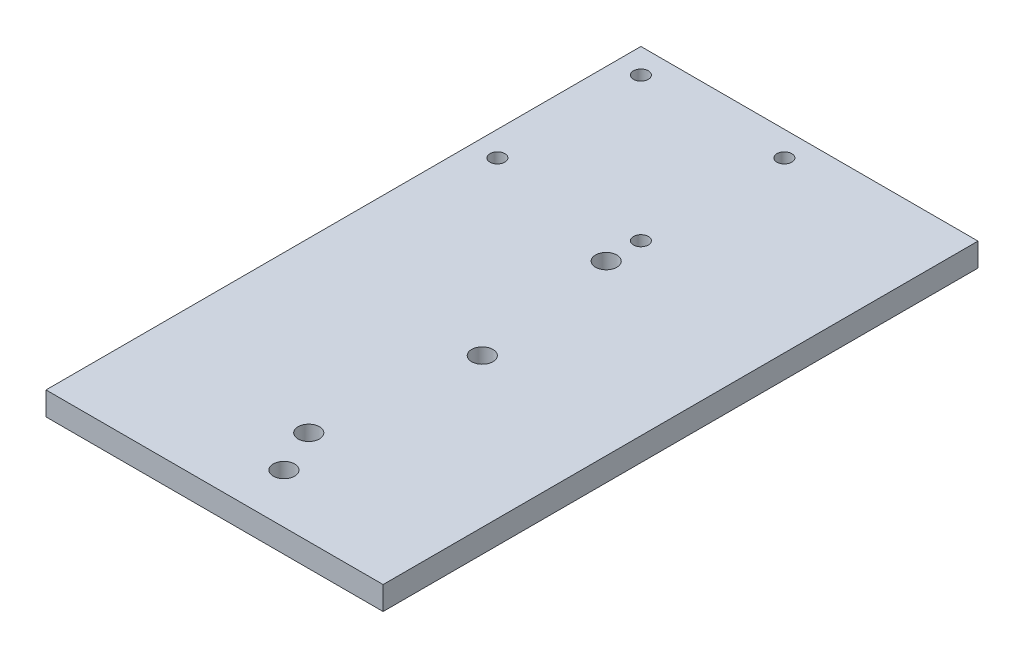
ISO-10303-21;
HEADER;
FILE_DESCRIPTION(('STEP AP214'),'2;1');
FILE_NAME('part.step','',(''),(''),'','','');
FILE_SCHEMA(('AUTOMOTIVE_DESIGN { 1 0 10303 214 1 1 1 1 }'));
ENDSEC;
DATA;
#1=APPLICATION_CONTEXT('core data for automotive mechanical design processes');
#2=APPLICATION_PROTOCOL_DEFINITION('international standard','automotive_design',2000,#1);
#3=PRODUCT_CONTEXT('',#1,'mechanical');
#4=PRODUCT('Part','Part','',(#3));
#5=PRODUCT_RELATED_PRODUCT_CATEGORY('part','',(#4));
#6=PRODUCT_DEFINITION_FORMATION('','',#4);
#7=PRODUCT_DEFINITION_CONTEXT('part definition',#1,'design');
#8=PRODUCT_DEFINITION('design','',#6,#7);
#9=PRODUCT_DEFINITION_SHAPE('','',#8);
#10=(LENGTH_UNIT() NAMED_UNIT(*) SI_UNIT(.MILLI.,.METRE.));
#11=(NAMED_UNIT(*) PLANE_ANGLE_UNIT() SI_UNIT($,.RADIAN.));
#12=(NAMED_UNIT(*) SI_UNIT($,.STERADIAN.) SOLID_ANGLE_UNIT());
#13=UNCERTAINTY_MEASURE_WITH_UNIT(LENGTH_MEASURE(1.E-05),#10,'distance_accuracy_value','');
#14=(GEOMETRIC_REPRESENTATION_CONTEXT(3) GLOBAL_UNCERTAINTY_ASSIGNED_CONTEXT((#13)) GLOBAL_UNIT_ASSIGNED_CONTEXT((#10,
#11,#12)) REPRESENTATION_CONTEXT('',''));
#15=CARTESIAN_POINT('',(0.,0.,0.));
#16=DIRECTION('',(0.,0.,1.));
#17=DIRECTION('',(1.,0.,0.));
#18=AXIS2_PLACEMENT_3D('',#15,#16,#17);
#19=CARTESIAN_POINT('',(0.,5.9944,0.));
#20=DIRECTION('',(0.,0.,-1.));
#21=DIRECTION('',(-1.,0.,0.));
#22=AXIS2_PLACEMENT_3D('',#19,#20,#21);
#23=PLANE('',#22);
#24=DIRECTION('',(1.,0.,0.));
#25=VECTOR('',#24,1.);
#26=CARTESIAN_POINT('',(0.,5.9944,0.));
#27=LINE('',#26,#25);
#28=CARTESIAN_POINT('',(2.54000000000002,5.9944,0.));
#29=VERTEX_POINT('',#28);
#30=CARTESIAN_POINT('',(88.9,5.9944,0.));
#31=VERTEX_POINT('',#30);
#32=EDGE_CURVE('E79',#29,#31,#27,.T.);
#33=ORIENTED_EDGE('',*,*,#32,.F.);
#34=DIRECTION('',(0.,1.,0.));
#35=VECTOR('',#34,1.);
#36=CARTESIAN_POINT('',(2.54000000000002,0.,0.));
#37=LINE('',#36,#35);
#38=CARTESIAN_POINT('',(2.54000000000002,0.,0.));
#39=VERTEX_POINT('',#38);
#40=EDGE_CURVE('E145',#39,#29,#37,.T.);
#41=ORIENTED_EDGE('',*,*,#40,.F.);
#42=DIRECTION('',(1.,0.,0.));
#43=VECTOR('',#42,1.);
#44=CARTESIAN_POINT('',(0.,0.,0.));
#45=LINE('',#44,#43);
#46=CARTESIAN_POINT('',(88.9,0.,0.));
#47=VERTEX_POINT('',#46);
#48=EDGE_CURVE('E87',#39,#47,#45,.T.);
#49=ORIENTED_EDGE('',*,*,#48,.T.);
#50=DIRECTION('',(0.,-1.,0.));
#51=VECTOR('',#50,1.);
#52=CARTESIAN_POINT('',(88.9,5.9944,0.));
#53=LINE('',#52,#51);
#54=EDGE_CURVE('E11',#31,#47,#53,.T.);
#55=ORIENTED_EDGE('',*,*,#54,.F.);
#56=EDGE_LOOP('',(#33,#41,#49,#55));
#57=FACE_BOUND('',#56,.T.);
#58=ADVANCED_FACE('F37',(#57),#23,.F.);
#59=CARTESIAN_POINT('',(88.9,5.9944,0.));
#60=DIRECTION('',(-1.,0.,0.));
#61=DIRECTION('',(0.,0.,1.));
#62=AXIS2_PLACEMENT_3D('',#59,#60,#61);
#63=PLANE('',#62);
#64=DIRECTION('',(0.,0.,-1.));
#65=VECTOR('',#64,1.);
#66=CARTESIAN_POINT('',(88.9,0.,0.));
#67=LINE('',#66,#65);
#68=CARTESIAN_POINT('',(88.9,0.,-152.4));
#69=VERTEX_POINT('',#68);
#70=EDGE_CURVE('E77',#47,#69,#67,.T.);
#71=ORIENTED_EDGE('',*,*,#70,.T.);
#72=DIRECTION('',(0.,-1.,0.));
#73=VECTOR('',#72,1.);
#74=CARTESIAN_POINT('',(88.9,5.9944,-152.4));
#75=LINE('',#74,#73);
#76=CARTESIAN_POINT('',(88.9,5.9944,-152.4));
#77=VERTEX_POINT('',#76);
#78=EDGE_CURVE('E44',#77,#69,#75,.T.);
#79=ORIENTED_EDGE('',*,*,#78,.F.);
#80=DIRECTION('',(0.,0.,-1.));
#81=VECTOR('',#80,1.);
#82=CARTESIAN_POINT('',(88.9,5.9944,0.));
#83=LINE('',#82,#81);
#84=EDGE_CURVE('E93',#31,#77,#83,.T.);
#85=ORIENTED_EDGE('',*,*,#84,.F.);
#86=ORIENTED_EDGE('',*,*,#54,.T.);
#87=EDGE_LOOP('',(#71,#79,#85,#86));
#88=FACE_BOUND('',#87,.T.);
#89=ADVANCED_FACE('F85',(#88),#63,.F.);
#90=CARTESIAN_POINT('',(0.,5.9944,-152.4));
#91=DIRECTION('',(0.,0.,-1.));
#92=DIRECTION('',(-1.,0.,0.));
#93=AXIS2_PLACEMENT_3D('',#90,#91,#92);
#94=PLANE('',#93);
#95=DIRECTION('',(0.,1.,0.));
#96=VECTOR('',#95,1.);
#97=CARTESIAN_POINT('',(2.54,0.,-152.4));
#98=LINE('',#97,#96);
#99=CARTESIAN_POINT('',(2.54000000000001,0.,-152.4));
#100=VERTEX_POINT('',#99);
#101=CARTESIAN_POINT('',(2.54,5.9944,-152.4));
#102=VERTEX_POINT('',#101);
#103=EDGE_CURVE('E51',#100,#102,#98,.T.);
#104=ORIENTED_EDGE('',*,*,#103,.T.);
#105=DIRECTION('',(1.,0.,0.));
#106=VECTOR('',#105,1.);
#107=CARTESIAN_POINT('',(0.,5.9944,-152.4));
#108=LINE('',#107,#106);
#109=EDGE_CURVE('E59',#102,#77,#108,.T.);
#110=ORIENTED_EDGE('',*,*,#109,.T.);
#111=ORIENTED_EDGE('',*,*,#78,.T.);
#112=DIRECTION('',(1.,0.,0.));
#113=VECTOR('',#112,1.);
#114=CARTESIAN_POINT('',(0.,0.,-152.4));
#115=LINE('',#114,#113);
#116=EDGE_CURVE('E73',#100,#69,#115,.T.);
#117=ORIENTED_EDGE('',*,*,#116,.F.);
#118=EDGE_LOOP('',(#104,#110,#111,#117));
#119=FACE_BOUND('',#118,.T.);
#120=ADVANCED_FACE('F82',(#119),#94,.T.);
#121=CARTESIAN_POINT('',(0.,5.9944,0.));
#122=DIRECTION('',(0.,1.,0.));
#123=DIRECTION('',(0.,0.,1.));
#124=AXIS2_PLACEMENT_3D('',#121,#122,#123);
#125=PLANE('',#124);
#126=DIRECTION('',(0.,0.,-1.));
#127=VECTOR('',#126,1.);
#128=CARTESIAN_POINT('',(2.54000000000002,5.9944,0.));
#129=LINE('',#128,#127);
#130=EDGE_CURVE('E139',#29,#102,#129,.T.);
#131=ORIENTED_EDGE('',*,*,#130,.F.);
#132=ORIENTED_EDGE('',*,*,#32,.T.);
#133=ORIENTED_EDGE('',*,*,#84,.T.);
#134=ORIENTED_EDGE('',*,*,#109,.F.);
#135=EDGE_LOOP('',(#131,#132,#133,#134));
#136=FACE_BOUND('',#135,.T.);
#137=CARTESIAN_POINT('',(45.6438,5.9944,-146.05));
#138=DIRECTION('',(0.,1.,0.));
#139=DIRECTION('',(0.,0.,1.));
#140=AXIS2_PLACEMENT_3D('',#137,#138,#139);
#141=CIRCLE('',#140,1.905);
#142=CARTESIAN_POINT('',(45.6438,5.9944,-144.145));
#143=VERTEX_POINT('',#142);
#144=EDGE_CURVE('E117',#143,#143,#141,.T.);
#145=ORIENTED_EDGE('',*,*,#144,.F.);
#146=EDGE_LOOP('',(#145));
#147=FACE_BOUND('',#146,.T.);
#148=CARTESIAN_POINT('',(8.89,5.9944,-146.05));
#149=DIRECTION('',(0.,1.,0.));
#150=DIRECTION('',(0.,0.,1.));
#151=AXIS2_PLACEMENT_3D('',#148,#149,#150);
#152=CIRCLE('',#151,1.90499999999999);
#153=CARTESIAN_POINT('',(8.89,5.9944,-144.145));
#154=VERTEX_POINT('',#153);
#155=EDGE_CURVE('E122',#154,#154,#152,.T.);
#156=ORIENTED_EDGE('',*,*,#155,.F.);
#157=EDGE_LOOP('',(#156));
#158=FACE_BOUND('',#157,.T.);
#159=CARTESIAN_POINT('',(8.89,5.9944,-109.2962));
#160=DIRECTION('',(0.,1.,0.));
#161=DIRECTION('',(0.,0.,1.));
#162=AXIS2_PLACEMENT_3D('',#159,#160,#161);
#163=CIRCLE('',#162,1.90500000000001);
#164=CARTESIAN_POINT('',(8.89,5.9944,-107.3912));
#165=VERTEX_POINT('',#164);
#166=EDGE_CURVE('E125',#165,#165,#163,.T.);
#167=ORIENTED_EDGE('',*,*,#166,.F.);
#168=EDGE_LOOP('',(#167));
#169=FACE_BOUND('',#168,.T.);
#170=CARTESIAN_POINT('',(45.6438,5.9944,-109.2962));
#171=DIRECTION('',(0.,1.,0.));
#172=DIRECTION('',(0.,0.,1.));
#173=AXIS2_PLACEMENT_3D('',#170,#171,#172);
#174=CIRCLE('',#173,1.905);
#175=CARTESIAN_POINT('',(45.6438,5.9944,-107.3912));
#176=VERTEX_POINT('',#175);
#177=EDGE_CURVE('E128',#176,#176,#174,.T.);
#178=ORIENTED_EDGE('',*,*,#177,.F.);
#179=EDGE_LOOP('',(#178));
#180=FACE_BOUND('',#179,.T.);
#181=CARTESIAN_POINT('',(50.8,5.9944,-63.5));
#182=DIRECTION('',(0.,1.,0.));
#183=DIRECTION('',(0.,0.,1.));
#184=AXIS2_PLACEMENT_3D('',#181,#182,#183);
#185=CIRCLE('',#184,2.7305);
#186=CARTESIAN_POINT('',(50.8,5.9944,-60.7695));
#187=VERTEX_POINT('',#186);
#188=EDGE_CURVE('E100',#187,#187,#185,.T.);
#189=ORIENTED_EDGE('',*,*,#188,.F.);
#190=EDGE_LOOP('',(#189));
#191=FACE_BOUND('',#190,.T.);
#192=CARTESIAN_POINT('',(50.8,5.9944,-12.7));
#193=DIRECTION('',(0.,1.,0.));
#194=DIRECTION('',(0.,0.,1.));
#195=AXIS2_PLACEMENT_3D('',#192,#193,#194);
#196=CIRCLE('',#195,2.7305);
#197=CARTESIAN_POINT('',(50.8,5.9944,-9.9695));
#198=VERTEX_POINT('',#197);
#199=EDGE_CURVE('E110',#198,#198,#196,.T.);
#200=ORIENTED_EDGE('',*,*,#199,.F.);
#201=EDGE_LOOP('',(#200));
#202=FACE_BOUND('',#201,.T.);
#203=CARTESIAN_POINT('',(45.72,5.9944,-100.33));
#204=DIRECTION('',(0.,1.,0.));
#205=DIRECTION('',(0.,0.,1.));
#206=AXIS2_PLACEMENT_3D('',#203,#204,#205);
#207=CIRCLE('',#206,2.7305);
#208=CARTESIAN_POINT('',(45.72,5.9944,-97.5995));
#209=VERTEX_POINT('',#208);
#210=EDGE_CURVE('E103',#209,#209,#207,.T.);
#211=ORIENTED_EDGE('',*,*,#210,.F.);
#212=EDGE_LOOP('',(#211));
#213=FACE_BOUND('',#212,.T.);
#214=CARTESIAN_POINT('',(45.72,5.9944,-24.13));
#215=DIRECTION('',(0.,1.,0.));
#216=DIRECTION('',(0.,0.,1.));
#217=AXIS2_PLACEMENT_3D('',#214,#215,#216);
#218=CIRCLE('',#217,2.7305);
#219=CARTESIAN_POINT('',(45.72,5.9944,-21.3995));
#220=VERTEX_POINT('',#219);
#221=EDGE_CURVE('E99',#220,#220,#218,.T.);
#222=ORIENTED_EDGE('',*,*,#221,.F.);
#223=EDGE_LOOP('',(#222));
#224=FACE_BOUND('',#223,.T.);
#225=ADVANCED_FACE('F152',(#136,#147,#158,#169,#180,#191,#202,#213,#224),#125,.T.);
#226=CARTESIAN_POINT('',(0.,0.,0.));
#227=DIRECTION('',(0.,1.,0.));
#228=DIRECTION('',(0.,0.,1.));
#229=AXIS2_PLACEMENT_3D('',#226,#227,#228);
#230=PLANE('',#229);
#231=CARTESIAN_POINT('',(45.6438,0.,-146.05));
#232=DIRECTION('',(0.,1.,0.));
#233=DIRECTION('',(0.,0.,1.));
#234=AXIS2_PLACEMENT_3D('',#231,#232,#233);
#235=CIRCLE('',#234,1.905);
#236=CARTESIAN_POINT('',(45.6438,0.,-144.145));
#237=VERTEX_POINT('',#236);
#238=EDGE_CURVE('E135',#237,#237,#235,.T.);
#239=ORIENTED_EDGE('',*,*,#238,.T.);
#240=EDGE_LOOP('',(#239));
#241=FACE_BOUND('',#240,.T.);
#242=CARTESIAN_POINT('',(8.89,0.,-146.05));
#243=DIRECTION('',(0.,1.,0.));
#244=DIRECTION('',(0.,0.,1.));
#245=AXIS2_PLACEMENT_3D('',#242,#243,#244);
#246=CIRCLE('',#245,1.90499999999999);
#247=CARTESIAN_POINT('',(8.89,0.,-144.145));
#248=VERTEX_POINT('',#247);
#249=EDGE_CURVE('E138',#248,#248,#246,.T.);
#250=ORIENTED_EDGE('',*,*,#249,.T.);
#251=EDGE_LOOP('',(#250));
#252=FACE_BOUND('',#251,.T.);
#253=CARTESIAN_POINT('',(8.89,0.,-109.2962));
#254=DIRECTION('',(0.,1.,0.));
#255=DIRECTION('',(0.,0.,1.));
#256=AXIS2_PLACEMENT_3D('',#253,#254,#255);
#257=CIRCLE('',#256,1.90500000000001);
#258=CARTESIAN_POINT('',(8.89,0.,-107.3912));
#259=VERTEX_POINT('',#258);
#260=EDGE_CURVE('E134',#259,#259,#257,.T.);
#261=ORIENTED_EDGE('',*,*,#260,.T.);
#262=EDGE_LOOP('',(#261));
#263=FACE_BOUND('',#262,.T.);
#264=CARTESIAN_POINT('',(45.6438,0.,-109.2962));
#265=DIRECTION('',(0.,1.,0.));
#266=DIRECTION('',(0.,0.,1.));
#267=AXIS2_PLACEMENT_3D('',#264,#265,#266);
#268=CIRCLE('',#267,1.905);
#269=CARTESIAN_POINT('',(45.6438,0.,-107.3912));
#270=VERTEX_POINT('',#269);
#271=EDGE_CURVE('E131',#270,#270,#268,.T.);
#272=ORIENTED_EDGE('',*,*,#271,.T.);
#273=EDGE_LOOP('',(#272));
#274=FACE_BOUND('',#273,.T.);
#275=CARTESIAN_POINT('',(50.8,0.,-63.5));
#276=DIRECTION('',(0.,1.,0.));
#277=DIRECTION('',(0.,0.,1.));
#278=AXIS2_PLACEMENT_3D('',#275,#276,#277);
#279=CIRCLE('',#278,2.7305);
#280=CARTESIAN_POINT('',(50.8,0.,-60.7695));
#281=VERTEX_POINT('',#280);
#282=EDGE_CURVE('E113',#281,#281,#279,.T.);
#283=ORIENTED_EDGE('',*,*,#282,.T.);
#284=EDGE_LOOP('',(#283));
#285=FACE_BOUND('',#284,.T.);
#286=CARTESIAN_POINT('',(50.8,0.,-12.7));
#287=DIRECTION('',(0.,1.,0.));
#288=DIRECTION('',(0.,0.,1.));
#289=AXIS2_PLACEMENT_3D('',#286,#287,#288);
#290=CIRCLE('',#289,2.7305);
#291=CARTESIAN_POINT('',(50.8,0.,-9.9695));
#292=VERTEX_POINT('',#291);
#293=EDGE_CURVE('E114',#292,#292,#290,.T.);
#294=ORIENTED_EDGE('',*,*,#293,.T.);
#295=EDGE_LOOP('',(#294));
#296=FACE_BOUND('',#295,.T.);
#297=CARTESIAN_POINT('',(45.72,0.,-100.33));
#298=DIRECTION('',(0.,1.,0.));
#299=DIRECTION('',(0.,0.,1.));
#300=AXIS2_PLACEMENT_3D('',#297,#298,#299);
#301=CIRCLE('',#300,2.7305);
#302=CARTESIAN_POINT('',(45.72,0.,-97.5995));
#303=VERTEX_POINT('',#302);
#304=EDGE_CURVE('E89',#303,#303,#301,.T.);
#305=ORIENTED_EDGE('',*,*,#304,.T.);
#306=EDGE_LOOP('',(#305));
#307=FACE_BOUND('',#306,.T.);
#308=CARTESIAN_POINT('',(45.72,0.,-24.13));
#309=DIRECTION('',(0.,1.,0.));
#310=DIRECTION('',(0.,0.,1.));
#311=AXIS2_PLACEMENT_3D('',#308,#309,#310);
#312=CIRCLE('',#311,2.7305);
#313=CARTESIAN_POINT('',(45.72,0.,-21.3995));
#314=VERTEX_POINT('',#313);
#315=EDGE_CURVE('E96',#314,#314,#312,.T.);
#316=ORIENTED_EDGE('',*,*,#315,.T.);
#317=EDGE_LOOP('',(#316));
#318=FACE_BOUND('',#317,.T.);
#319=ORIENTED_EDGE('',*,*,#48,.F.);
#320=DIRECTION('',(0.,0.,-1.));
#321=VECTOR('',#320,1.);
#322=CARTESIAN_POINT('',(2.54,0.,-152.4));
#323=LINE('',#322,#321);
#324=EDGE_CURVE('E78',#39,#100,#323,.T.);
#325=ORIENTED_EDGE('',*,*,#324,.T.);
#326=ORIENTED_EDGE('',*,*,#116,.T.);
#327=ORIENTED_EDGE('',*,*,#70,.F.);
#328=EDGE_LOOP('',(#319,#325,#326,#327));
#329=FACE_BOUND('',#328,.T.);
#330=ADVANCED_FACE('F75',(#241,#252,#263,#274,#285,#296,#307,#318,#329),#230,.F.);
#331=CARTESIAN_POINT('',(45.72,0.,-24.13));
#332=DIRECTION('',(0.,1.,0.));
#333=DIRECTION('',(0.,0.,1.));
#334=AXIS2_PLACEMENT_3D('',#331,#332,#333);
#335=CYLINDRICAL_SURFACE('',#334,2.7305);
#336=ORIENTED_EDGE('',*,*,#315,.F.);
#337=EDGE_LOOP('',(#336));
#338=FACE_BOUND('',#337,.T.);
#339=ORIENTED_EDGE('',*,*,#221,.T.);
#340=EDGE_LOOP('',(#339));
#341=FACE_BOUND('',#340,.T.);
#342=ADVANCED_FACE('F182',(#338,#341),#335,.F.);
#343=CARTESIAN_POINT('',(45.72,0.,-100.33));
#344=DIRECTION('',(0.,1.,0.));
#345=DIRECTION('',(0.,0.,1.));
#346=AXIS2_PLACEMENT_3D('',#343,#344,#345);
#347=CYLINDRICAL_SURFACE('',#346,2.7305);
#348=ORIENTED_EDGE('',*,*,#304,.F.);
#349=EDGE_LOOP('',(#348));
#350=FACE_BOUND('',#349,.T.);
#351=ORIENTED_EDGE('',*,*,#210,.T.);
#352=EDGE_LOOP('',(#351));
#353=FACE_BOUND('',#352,.T.);
#354=ADVANCED_FACE('F188',(#350,#353),#347,.F.);
#355=CARTESIAN_POINT('',(50.8,0.,-12.7));
#356=DIRECTION('',(0.,1.,0.));
#357=DIRECTION('',(0.,0.,1.));
#358=AXIS2_PLACEMENT_3D('',#355,#356,#357);
#359=CYLINDRICAL_SURFACE('',#358,2.7305);
#360=ORIENTED_EDGE('',*,*,#199,.T.);
#361=EDGE_LOOP('',(#360));
#362=FACE_BOUND('',#361,.T.);
#363=ORIENTED_EDGE('',*,*,#293,.F.);
#364=EDGE_LOOP('',(#363));
#365=FACE_BOUND('',#364,.T.);
#366=ADVANCED_FACE('F192',(#362,#365),#359,.F.);
#367=CARTESIAN_POINT('',(50.8,0.,-63.5));
#368=DIRECTION('',(0.,1.,0.));
#369=DIRECTION('',(0.,0.,1.));
#370=AXIS2_PLACEMENT_3D('',#367,#368,#369);
#371=CYLINDRICAL_SURFACE('',#370,2.7305);
#372=ORIENTED_EDGE('',*,*,#188,.T.);
#373=EDGE_LOOP('',(#372));
#374=FACE_BOUND('',#373,.T.);
#375=ORIENTED_EDGE('',*,*,#282,.F.);
#376=EDGE_LOOP('',(#375));
#377=FACE_BOUND('',#376,.T.);
#378=ADVANCED_FACE('F196',(#374,#377),#371,.F.);
#379=CARTESIAN_POINT('',(45.6438,0.,-109.2962));
#380=DIRECTION('',(0.,1.,0.));
#381=DIRECTION('',(0.,0.,1.));
#382=AXIS2_PLACEMENT_3D('',#379,#380,#381);
#383=CYLINDRICAL_SURFACE('',#382,1.905);
#384=ORIENTED_EDGE('',*,*,#177,.T.);
#385=EDGE_LOOP('',(#384));
#386=FACE_BOUND('',#385,.T.);
#387=ORIENTED_EDGE('',*,*,#271,.F.);
#388=EDGE_LOOP('',(#387));
#389=FACE_BOUND('',#388,.T.);
#390=ADVANCED_FACE('F200',(#386,#389),#383,.F.);
#391=CARTESIAN_POINT('',(8.89,0.,-109.2962));
#392=DIRECTION('',(0.,1.,0.));
#393=DIRECTION('',(0.,0.,1.));
#394=AXIS2_PLACEMENT_3D('',#391,#392,#393);
#395=CYLINDRICAL_SURFACE('',#394,1.90500000000001);
#396=ORIENTED_EDGE('',*,*,#166,.T.);
#397=EDGE_LOOP('',(#396));
#398=FACE_BOUND('',#397,.T.);
#399=ORIENTED_EDGE('',*,*,#260,.F.);
#400=EDGE_LOOP('',(#399));
#401=FACE_BOUND('',#400,.T.);
#402=ADVANCED_FACE('F203',(#398,#401),#395,.F.);
#403=CARTESIAN_POINT('',(8.89,0.,-146.05));
#404=DIRECTION('',(0.,1.,0.));
#405=DIRECTION('',(0.,0.,1.));
#406=AXIS2_PLACEMENT_3D('',#403,#404,#405);
#407=CYLINDRICAL_SURFACE('',#406,1.90499999999999);
#408=ORIENTED_EDGE('',*,*,#155,.T.);
#409=EDGE_LOOP('',(#408));
#410=FACE_BOUND('',#409,.T.);
#411=ORIENTED_EDGE('',*,*,#249,.F.);
#412=EDGE_LOOP('',(#411));
#413=FACE_BOUND('',#412,.T.);
#414=ADVANCED_FACE('F167',(#410,#413),#407,.F.);
#415=CARTESIAN_POINT('',(45.6438,0.,-146.05));
#416=DIRECTION('',(0.,1.,0.));
#417=DIRECTION('',(0.,0.,1.));
#418=AXIS2_PLACEMENT_3D('',#415,#416,#417);
#419=CYLINDRICAL_SURFACE('',#418,1.905);
#420=ORIENTED_EDGE('',*,*,#144,.T.);
#421=EDGE_LOOP('',(#420));
#422=FACE_BOUND('',#421,.T.);
#423=ORIENTED_EDGE('',*,*,#238,.F.);
#424=EDGE_LOOP('',(#423));
#425=FACE_BOUND('',#424,.T.);
#426=ADVANCED_FACE('F162',(#422,#425),#419,.F.);
#427=CARTESIAN_POINT('',(2.54,0.,-152.4));
#428=DIRECTION('',(1.,0.,0.));
#429=DIRECTION('',(0.,0.,-1.));
#430=AXIS2_PLACEMENT_3D('',#427,#428,#429);
#431=PLANE('',#430);
#432=ORIENTED_EDGE('',*,*,#130,.T.);
#433=ORIENTED_EDGE('',*,*,#103,.F.);
#434=ORIENTED_EDGE('',*,*,#324,.F.);
#435=ORIENTED_EDGE('',*,*,#40,.T.);
#436=EDGE_LOOP('',(#432,#433,#434,#435));
#437=FACE_BOUND('',#436,.T.);
#438=ADVANCED_FACE('F160',(#437),#431,.F.);
#439=CLOSED_SHELL('',(#58,#89,#120,#225,#330,#342,#354,#366,#378,#390,#402,#414,#426,#438));
#440=MANIFOLD_SOLID_BREP('B2',#439);
#441=ADVANCED_BREP_SHAPE_REPRESENTATION('',(#18,#440),#14);
#442=SHAPE_DEFINITION_REPRESENTATION(#9,#441);
ENDSEC;
END-ISO-10303-21;
